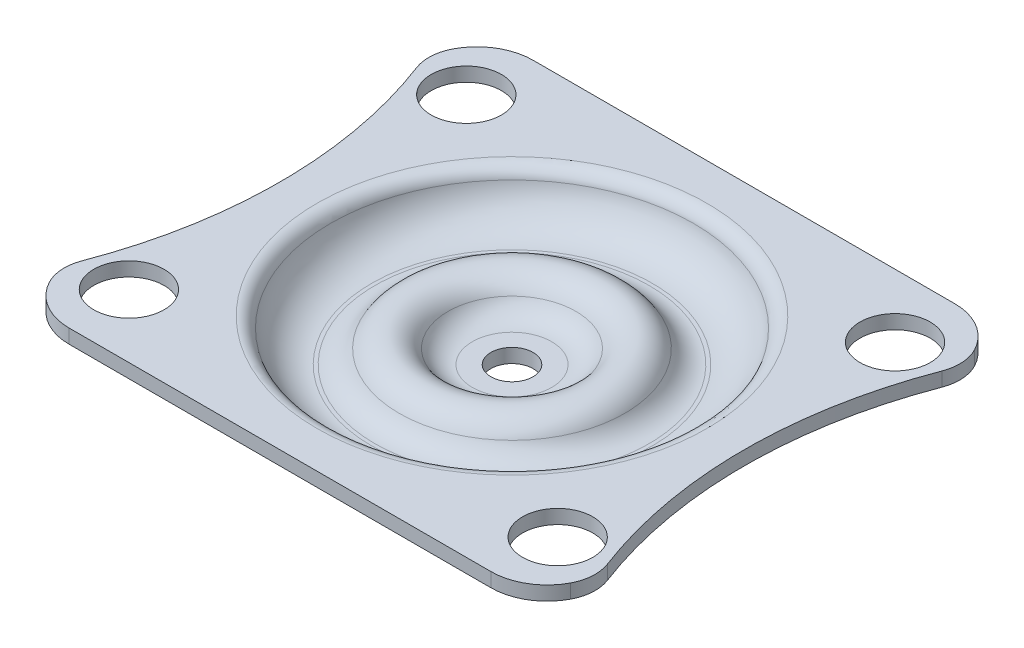
ISO-10303-21;
HEADER;
FILE_DESCRIPTION(('STEP AP214'),'2;1');
FILE_NAME('part.step','',(''),(''),'','','');
FILE_SCHEMA(('AUTOMOTIVE_DESIGN { 1 0 10303 214 1 1 1 1 }'));
ENDSEC;
DATA;
#1=APPLICATION_CONTEXT('core data for automotive mechanical design processes');
#2=APPLICATION_PROTOCOL_DEFINITION('international standard','automotive_design',2000,#1);
#3=PRODUCT_CONTEXT('',#1,'mechanical');
#4=PRODUCT('Part','Part','',(#3));
#5=PRODUCT_RELATED_PRODUCT_CATEGORY('part','',(#4));
#6=PRODUCT_DEFINITION_FORMATION('','',#4);
#7=PRODUCT_DEFINITION_CONTEXT('part definition',#1,'design');
#8=PRODUCT_DEFINITION('design','',#6,#7);
#9=PRODUCT_DEFINITION_SHAPE('','',#8);
#10=(LENGTH_UNIT() NAMED_UNIT(*) SI_UNIT(.MILLI.,.METRE.));
#11=(NAMED_UNIT(*) PLANE_ANGLE_UNIT() SI_UNIT($,.RADIAN.));
#12=(NAMED_UNIT(*) SI_UNIT($,.STERADIAN.) SOLID_ANGLE_UNIT());
#13=UNCERTAINTY_MEASURE_WITH_UNIT(LENGTH_MEASURE(1.E-05),#10,'distance_accuracy_value','');
#14=(GEOMETRIC_REPRESENTATION_CONTEXT(3) GLOBAL_UNCERTAINTY_ASSIGNED_CONTEXT((#13)) GLOBAL_UNIT_ASSIGNED_CONTEXT((#10,
#11,#12)) REPRESENTATION_CONTEXT('',''));
#15=CARTESIAN_POINT('',(0.,0.,0.));
#16=DIRECTION('',(0.,0.,1.));
#17=DIRECTION('',(1.,0.,0.));
#18=AXIS2_PLACEMENT_3D('',#15,#16,#17);
#19=CARTESIAN_POINT('',(-2.82179676972449,-4.,0.));
#20=DIRECTION('',(0.,-1.,0.));
#21=DIRECTION('',(0.,0.,-1.));
#22=AXIS2_PLACEMENT_3D('',#19,#20,#21);
#23=PLANE('',#22);
#24=CARTESIAN_POINT('',(0.,-4.,0.));
#25=DIRECTION('',(0.,1.,0.));
#26=DIRECTION('',(0.,0.,1.));
#27=AXIS2_PLACEMENT_3D('',#24,#25,#26);
#28=CIRCLE('',#27,1.5);
#29=CARTESIAN_POINT('',(0.,-4.,1.5));
#30=VERTEX_POINT('',#29);
#31=EDGE_CURVE('E11',#30,#30,#28,.T.);
#32=ORIENTED_EDGE('',*,*,#31,.T.);
#33=EDGE_LOOP('',(#32));
#34=FACE_BOUND('',#33,.T.);
#35=CARTESIAN_POINT('',(0.,-4.,0.));
#36=DIRECTION('',(0.,1.,0.));
#37=DIRECTION('',(0.,0.,1.));
#38=AXIS2_PLACEMENT_3D('',#35,#36,#37);
#39=CIRCLE('',#38,2.82179676972449);
#40=CARTESIAN_POINT('',(0.,-4.,2.82179676972449));
#41=VERTEX_POINT('',#40);
#42=EDGE_CURVE('E192',#41,#41,#39,.T.);
#43=ORIENTED_EDGE('',*,*,#42,.F.);
#44=EDGE_LOOP('',(#43));
#45=FACE_BOUND('',#44,.T.);
#46=ADVANCED_FACE('F33',(#34,#45),#23,.T.);
#47=CARTESIAN_POINT('',(0.,5.37373737373738,0.));
#48=DIRECTION('',(0.,1.,0.));
#49=DIRECTION('',(0.,0.,1.));
#50=AXIS2_PLACEMENT_3D('',#47,#48,#49);
#51=CYLINDRICAL_SURFACE('',#50,1.5);
#52=ORIENTED_EDGE('',*,*,#31,.F.);
#53=EDGE_LOOP('',(#52));
#54=FACE_BOUND('',#53,.T.);
#55=CARTESIAN_POINT('',(0.,-3.,0.));
#56=DIRECTION('',(0.,1.,0.));
#57=DIRECTION('',(0.,0.,1.));
#58=AXIS2_PLACEMENT_3D('',#55,#56,#57);
#59=CIRCLE('',#58,1.5);
#60=CARTESIAN_POINT('',(0.,-3.,1.5));
#61=VERTEX_POINT('',#60);
#62=EDGE_CURVE('E41',#61,#61,#59,.T.);
#63=ORIENTED_EDGE('',*,*,#62,.T.);
#64=EDGE_LOOP('',(#63));
#65=FACE_BOUND('',#64,.T.);
#66=ADVANCED_FACE('F250',(#54,#65),#51,.F.);
#67=CARTESIAN_POINT('',(-2.82179676972449,-3.,0.));
#68=DIRECTION('',(0.,-1.,0.));
#69=DIRECTION('',(0.,0.,-1.));
#70=AXIS2_PLACEMENT_3D('',#67,#68,#69);
#71=PLANE('',#70);
#72=ORIENTED_EDGE('',*,*,#62,.F.);
#73=EDGE_LOOP('',(#72));
#74=FACE_BOUND('',#73,.T.);
#75=CARTESIAN_POINT('',(0.,-3.,0.));
#76=DIRECTION('',(0.,1.,0.));
#77=DIRECTION('',(0.,0.,1.));
#78=AXIS2_PLACEMENT_3D('',#75,#76,#77);
#79=CIRCLE('',#78,2.82179676972449);
#80=CARTESIAN_POINT('',(0.,-3.,2.82179676972449));
#81=VERTEX_POINT('',#80);
#82=EDGE_CURVE('E245',#81,#81,#79,.T.);
#83=ORIENTED_EDGE('',*,*,#82,.T.);
#84=EDGE_LOOP('',(#83));
#85=FACE_BOUND('',#84,.T.);
#86=ADVANCED_FACE('F252',(#74,#85),#71,.F.);
#87=CARTESIAN_POINT('',(0.,-1.,0.));
#88=DIRECTION('',(0.,1.,0.));
#89=DIRECTION('',(0.,0.,1.));
#90=AXIS2_PLACEMENT_3D('',#87,#88,#89);
#91=TOROIDAL_SURFACE('',#90,2.82179676972449,2.);
#92=ORIENTED_EDGE('',*,*,#82,.F.);
#93=EDGE_LOOP('',(#92));
#94=FACE_BOUND('',#93,.T.);
#95=CARTESIAN_POINT('',(0.,-2.,0.));
#96=DIRECTION('',(0.,1.,0.));
#97=DIRECTION('',(0.,0.,1.));
#98=AXIS2_PLACEMENT_3D('',#95,#96,#97);
#99=CIRCLE('',#98,4.55384757729337);
#100=CARTESIAN_POINT('',(0.,-2.,4.55384757729337));
#101=VERTEX_POINT('',#100);
#102=EDGE_CURVE('E242',#101,#101,#99,.T.);
#103=ORIENTED_EDGE('',*,*,#102,.T.);
#104=EDGE_LOOP('',(#103));
#105=FACE_BOUND('',#104,.T.);
#106=ADVANCED_FACE('F255',(#94,#105),#91,.F.);
#107=CARTESIAN_POINT('',(0.,-3.,0.));
#108=DIRECTION('',(0.,1.,0.));
#109=DIRECTION('',(0.,0.,1.));
#110=AXIS2_PLACEMENT_3D('',#107,#108,#109);
#111=TOROIDAL_SURFACE('',#110,6.28589838486224,2.);
#112=ORIENTED_EDGE('',*,*,#102,.F.);
#113=EDGE_LOOP('',(#112));
#114=FACE_BOUND('',#113,.T.);
#115=CARTESIAN_POINT('',(0.,-2.,0.));
#116=DIRECTION('',(0.,1.,0.));
#117=DIRECTION('',(0.,0.,1.));
#118=AXIS2_PLACEMENT_3D('',#115,#116,#117);
#119=CIRCLE('',#118,8.01794919243112);
#120=CARTESIAN_POINT('',(0.,-2.,8.01794919243112));
#121=VERTEX_POINT('',#120);
#122=EDGE_CURVE('E239',#121,#121,#119,.T.);
#123=ORIENTED_EDGE('',*,*,#122,.T.);
#124=EDGE_LOOP('',(#123));
#125=FACE_BOUND('',#124,.T.);
#126=ADVANCED_FACE('F261',(#114,#125),#111,.T.);
#127=CARTESIAN_POINT('',(0.,-1.,0.));
#128=DIRECTION('',(0.,1.,0.));
#129=DIRECTION('',(0.,0.,1.));
#130=AXIS2_PLACEMENT_3D('',#127,#128,#129);
#131=TOROIDAL_SURFACE('',#130,9.75,2.);
#132=ORIENTED_EDGE('',*,*,#122,.F.);
#133=EDGE_LOOP('',(#132));
#134=FACE_BOUND('',#133,.T.);
#135=CARTESIAN_POINT('',(0.,-3.,0.));
#136=DIRECTION('',(0.,1.,0.));
#137=DIRECTION('',(0.,0.,1.));
#138=AXIS2_PLACEMENT_3D('',#135,#136,#137);
#139=CIRCLE('',#138,9.75);
#140=CARTESIAN_POINT('',(0.,-3.,9.75));
#141=VERTEX_POINT('',#140);
#142=EDGE_CURVE('E236',#141,#141,#139,.T.);
#143=ORIENTED_EDGE('',*,*,#142,.T.);
#144=EDGE_LOOP('',(#143));
#145=FACE_BOUND('',#144,.T.);
#146=ADVANCED_FACE('F267',(#134,#145),#131,.F.);
#147=CARTESIAN_POINT('',(-10.,-3.,0.));
#148=DIRECTION('',(0.,-1.,0.));
#149=DIRECTION('',(0.,0.,-1.));
#150=AXIS2_PLACEMENT_3D('',#147,#148,#149);
#151=PLANE('',#150);
#152=ORIENTED_EDGE('',*,*,#142,.F.);
#153=EDGE_LOOP('',(#152));
#154=FACE_BOUND('',#153,.T.);
#155=CARTESIAN_POINT('',(0.,-3.,0.));
#156=DIRECTION('',(0.,1.,0.));
#157=DIRECTION('',(0.,0.,1.));
#158=AXIS2_PLACEMENT_3D('',#155,#156,#157);
#159=CIRCLE('',#158,10.);
#160=CARTESIAN_POINT('',(0.,-3.,10.));
#161=VERTEX_POINT('',#160);
#162=EDGE_CURVE('E233',#161,#161,#159,.T.);
#163=ORIENTED_EDGE('',*,*,#162,.T.);
#164=EDGE_LOOP('',(#163));
#165=FACE_BOUND('',#164,.T.);
#166=ADVANCED_FACE('F273',(#154,#165),#151,.F.);
#167=CARTESIAN_POINT('',(0.,0.,0.));
#168=DIRECTION('',(0.,1.,0.));
#169=DIRECTION('',(0.,0.,1.));
#170=AXIS2_PLACEMENT_3D('',#167,#168,#169);
#171=TOROIDAL_SURFACE('',#170,10.,3.);
#172=ORIENTED_EDGE('',*,*,#162,.F.);
#173=EDGE_LOOP('',(#172));
#174=FACE_BOUND('',#173,.T.);
#175=CARTESIAN_POINT('',(0.,-0.75,0.));
#176=DIRECTION('',(0.,1.,0.));
#177=DIRECTION('',(0.,0.,1.));
#178=AXIS2_PLACEMENT_3D('',#175,#176,#177);
#179=CIRCLE('',#178,12.9047375096556);
#180=CARTESIAN_POINT('',(0.,-0.75,12.9047375096556));
#181=VERTEX_POINT('',#180);
#182=EDGE_CURVE('E230',#181,#181,#179,.T.);
#183=ORIENTED_EDGE('',*,*,#182,.T.);
#184=EDGE_LOOP('',(#183));
#185=FACE_BOUND('',#184,.T.);
#186=ADVANCED_FACE('F279',(#174,#185),#171,.F.);
#187=CARTESIAN_POINT('',(0.,-1.,0.));
#188=DIRECTION('',(0.,1.,0.));
#189=DIRECTION('',(0.,0.,1.));
#190=AXIS2_PLACEMENT_3D('',#187,#188,#189);
#191=TOROIDAL_SURFACE('',#190,13.8729833462074,1.);
#192=ORIENTED_EDGE('',*,*,#182,.F.);
#193=EDGE_LOOP('',(#192));
#194=FACE_BOUND('',#193,.T.);
#195=CARTESIAN_POINT('',(0.,0.,0.));
#196=DIRECTION('',(0.,1.,0.));
#197=DIRECTION('',(0.,0.,1.));
#198=AXIS2_PLACEMENT_3D('',#195,#196,#197);
#199=CIRCLE('',#198,13.8729833462074);
#200=CARTESIAN_POINT('',(0.,0.,13.8729833462074));
#201=VERTEX_POINT('',#200);
#202=EDGE_CURVE('E227',#201,#201,#199,.T.);
#203=ORIENTED_EDGE('',*,*,#202,.T.);
#204=EDGE_LOOP('',(#203));
#205=FACE_BOUND('',#204,.T.);
#206=ADVANCED_FACE('F285',(#194,#205),#191,.T.);
#207=CARTESIAN_POINT('',(-15.,0.,0.));
#208=DIRECTION('',(0.,-1.,0.));
#209=DIRECTION('',(0.,0.,-1.));
#210=AXIS2_PLACEMENT_3D('',#207,#208,#209);
#211=PLANE('',#210);
#212=ORIENTED_EDGE('',*,*,#202,.F.);
#213=EDGE_LOOP('',(#212));
#214=FACE_BOUND('',#213,.T.);
#215=CARTESIAN_POINT('',(15.25,0.,12.));
#216=DIRECTION('',(0.,1.,0.));
#217=DIRECTION('',(0.,0.,1.));
#218=AXIS2_PLACEMENT_3D('',#215,#216,#217);
#219=CIRCLE('',#218,2.5);
#220=CARTESIAN_POINT('',(15.25,0.,14.5));
#221=VERTEX_POINT('',#220);
#222=EDGE_CURVE('E301',#221,#221,#219,.T.);
#223=ORIENTED_EDGE('',*,*,#222,.F.);
#224=EDGE_LOOP('',(#223));
#225=FACE_BOUND('',#224,.T.);
#226=CARTESIAN_POINT('',(-15.25,0.,-12.));
#227=DIRECTION('',(0.,1.,0.));
#228=DIRECTION('',(0.,0.,1.));
#229=AXIS2_PLACEMENT_3D('',#226,#227,#228);
#230=CIRCLE('',#229,2.5);
#231=CARTESIAN_POINT('',(-15.25,0.,-9.5));
#232=VERTEX_POINT('',#231);
#233=EDGE_CURVE('E305',#232,#232,#230,.T.);
#234=ORIENTED_EDGE('',*,*,#233,.F.);
#235=EDGE_LOOP('',(#234));
#236=FACE_BOUND('',#235,.T.);
#237=CARTESIAN_POINT('',(15.25,0.,-12.));
#238=DIRECTION('',(0.,1.,0.));
#239=DIRECTION('',(0.,0.,-1.));
#240=AXIS2_PLACEMENT_3D('',#237,#238,#239);
#241=CIRCLE('',#240,2.5);
#242=CARTESIAN_POINT('',(15.25,0.,-14.5));
#243=VERTEX_POINT('',#242);
#244=EDGE_CURVE('E309',#243,#243,#241,.T.);
#245=ORIENTED_EDGE('',*,*,#244,.F.);
#246=EDGE_LOOP('',(#245));
#247=FACE_BOUND('',#246,.T.);
#248=CARTESIAN_POINT('',(-15.25,0.,12.));
#249=DIRECTION('',(0.,1.,0.));
#250=DIRECTION('',(0.,0.,-1.));
#251=AXIS2_PLACEMENT_3D('',#248,#249,#250);
#252=CIRCLE('',#251,2.5);
#253=CARTESIAN_POINT('',(-15.25,0.,9.5));
#254=VERTEX_POINT('',#253);
#255=EDGE_CURVE('E313',#254,#254,#252,.T.);
#256=ORIENTED_EDGE('',*,*,#255,.F.);
#257=EDGE_LOOP('',(#256));
#258=FACE_BOUND('',#257,.T.);
#259=CARTESIAN_POINT('',(-15.8823529411764,0.,12.970588235294));
#260=DIRECTION('',(0.,1.,0.));
#261=DIRECTION('',(0.,0.,1.));
#262=AXIS2_PLACEMENT_3D('',#259,#260,#261);
#263=CIRCLE('',#262,3.);
#264=CARTESIAN_POINT('',(-18.6865431103948,0.,11.9045124899274));
#265=VERTEX_POINT('',#264);
#266=CARTESIAN_POINT('',(-18.529411764706,0.,14.3823529411762));
#267=VERTEX_POINT('',#266);
#268=EDGE_CURVE('E156',#265,#267,#263,.T.);
#269=ORIENTED_EDGE('',*,*,#268,.T.);
#270=CARTESIAN_POINT('',(-15.,0.,12.5));
#271=DIRECTION('',(0.,1.,0.));
#272=DIRECTION('',(0.,0.,-1.));
#273=AXIS2_PLACEMENT_3D('',#270,#271,#272);
#274=CIRCLE('',#273,3.99999999999995);
#275=CARTESIAN_POINT('',(-15.,0.,16.5));
#276=VERTEX_POINT('',#275);
#277=EDGE_CURVE('E159',#267,#276,#274,.T.);
#278=ORIENTED_EDGE('',*,*,#277,.T.);
#279=DIRECTION('',(1.,0.,0.));
#280=VECTOR('',#279,1.);
#281=CARTESIAN_POINT('',(-15.,0.,16.5));
#282=LINE('',#281,#280);
#283=CARTESIAN_POINT('',(15.,0.,16.4999999999999));
#284=VERTEX_POINT('',#283);
#285=EDGE_CURVE('E163',#276,#284,#282,.T.);
#286=ORIENTED_EDGE('',*,*,#285,.T.);
#287=CARTESIAN_POINT('',(15.,0.,12.5));
#288=DIRECTION('',(0.,1.,0.));
#289=DIRECTION('',(0.,0.,1.));
#290=AXIS2_PLACEMENT_3D('',#287,#288,#289);
#291=CIRCLE('',#290,3.99999999999995);
#292=CARTESIAN_POINT('',(18.529411764706,0.,14.3823529411761));
#293=VERTEX_POINT('',#292);
#294=EDGE_CURVE('E166',#284,#293,#291,.T.);
#295=ORIENTED_EDGE('',*,*,#294,.T.);
#296=CARTESIAN_POINT('',(15.8823529411764,0.,12.970588235294));
#297=DIRECTION('',(0.,1.,0.));
#298=DIRECTION('',(0.,0.,-1.));
#299=AXIS2_PLACEMENT_3D('',#296,#297,#298);
#300=CIRCLE('',#299,3.);
#301=CARTESIAN_POINT('',(18.6865431103948,0.,11.9045124899274));
#302=VERTEX_POINT('',#301);
#303=EDGE_CURVE('E169',#293,#302,#300,.T.);
#304=ORIENTED_EDGE('',*,*,#303,.T.);
#305=CARTESIAN_POINT('',(50.,0.,0.));
#306=DIRECTION('',(0.,-1.,0.));
#307=DIRECTION('',(0.,0.,-1.));
#308=AXIS2_PLACEMENT_3D('',#305,#306,#307);
#309=CIRCLE('',#308,33.5);
#310=CARTESIAN_POINT('',(18.6865431103948,0.,-11.9045124899274));
#311=VERTEX_POINT('',#310);
#312=EDGE_CURVE('E172',#302,#311,#309,.T.);
#313=ORIENTED_EDGE('',*,*,#312,.T.);
#314=CARTESIAN_POINT('',(15.8823529411764,0.,-12.970588235294));
#315=DIRECTION('',(0.,1.,0.));
#316=DIRECTION('',(0.,0.,1.));
#317=AXIS2_PLACEMENT_3D('',#314,#315,#316);
#318=CIRCLE('',#317,3.);
#319=CARTESIAN_POINT('',(18.529411764706,0.,-14.3823529411762));
#320=VERTEX_POINT('',#319);
#321=EDGE_CURVE('E175',#311,#320,#318,.T.);
#322=ORIENTED_EDGE('',*,*,#321,.T.);
#323=CARTESIAN_POINT('',(15.,0.,-12.5));
#324=DIRECTION('',(0.,1.,0.));
#325=DIRECTION('',(0.,0.,-1.));
#326=AXIS2_PLACEMENT_3D('',#323,#324,#325);
#327=CIRCLE('',#326,3.99999999999995);
#328=CARTESIAN_POINT('',(15.,0.,-16.5));
#329=VERTEX_POINT('',#328);
#330=EDGE_CURVE('E178',#320,#329,#327,.T.);
#331=ORIENTED_EDGE('',*,*,#330,.T.);
#332=DIRECTION('',(-1.,0.,0.));
#333=VECTOR('',#332,1.);
#334=CARTESIAN_POINT('',(-15.,0.,-16.5));
#335=LINE('',#334,#333);
#336=CARTESIAN_POINT('',(-15.,0.,-16.5));
#337=VERTEX_POINT('',#336);
#338=EDGE_CURVE('E181',#329,#337,#335,.T.);
#339=ORIENTED_EDGE('',*,*,#338,.T.);
#340=CARTESIAN_POINT('',(-15.,0.,-12.5));
#341=DIRECTION('',(0.,1.,0.));
#342=DIRECTION('',(0.,0.,1.));
#343=AXIS2_PLACEMENT_3D('',#340,#341,#342);
#344=CIRCLE('',#343,3.99999999999995);
#345=CARTESIAN_POINT('',(-18.529411764706,0.,-14.3823529411761));
#346=VERTEX_POINT('',#345);
#347=EDGE_CURVE('E184',#337,#346,#344,.T.);
#348=ORIENTED_EDGE('',*,*,#347,.T.);
#349=CARTESIAN_POINT('',(-15.8823529411764,0.,-12.970588235294));
#350=DIRECTION('',(0.,1.,0.));
#351=DIRECTION('',(0.,0.,-1.));
#352=AXIS2_PLACEMENT_3D('',#349,#350,#351);
#353=CIRCLE('',#352,3.);
#354=CARTESIAN_POINT('',(-18.6865431103948,0.,-11.9045124899274));
#355=VERTEX_POINT('',#354);
#356=EDGE_CURVE('E133',#346,#355,#353,.T.);
#357=ORIENTED_EDGE('',*,*,#356,.T.);
#358=CARTESIAN_POINT('',(-50.,0.,0.));
#359=DIRECTION('',(0.,-1.,0.));
#360=DIRECTION('',(0.,0.,1.));
#361=AXIS2_PLACEMENT_3D('',#358,#359,#360);
#362=CIRCLE('',#361,33.5);
#363=EDGE_CURVE('E187',#355,#265,#362,.T.);
#364=ORIENTED_EDGE('',*,*,#363,.T.);
#365=EDGE_LOOP('',(#269,#278,#286,#295,#304,#313,#322,#331,#339,#348,#357,#364));
#366=FACE_BOUND('',#365,.T.);
#367=ADVANCED_FACE('F291',(#214,#225,#236,#247,#258,#366),#211,.F.);
#368=CARTESIAN_POINT('',(-15.,-1.,0.));
#369=DIRECTION('',(0.,-1.,0.));
#370=DIRECTION('',(0.,0.,-1.));
#371=AXIS2_PLACEMENT_3D('',#368,#369,#370);
#372=PLANE('',#371);
#373=CARTESIAN_POINT('',(0.,-1.,0.));
#374=DIRECTION('',(0.,1.,0.));
#375=DIRECTION('',(0.,0.,1.));
#376=AXIS2_PLACEMENT_3D('',#373,#374,#375);
#377=CIRCLE('',#376,13.8729833462074);
#378=CARTESIAN_POINT('',(0.,-1.,13.8729833462074));
#379=VERTEX_POINT('',#378);
#380=EDGE_CURVE('E224',#379,#379,#377,.T.);
#381=ORIENTED_EDGE('',*,*,#380,.T.);
#382=EDGE_LOOP('',(#381));
#383=FACE_BOUND('',#382,.T.);
#384=CARTESIAN_POINT('',(15.25,-1.,12.));
#385=DIRECTION('',(0.,1.,0.));
#386=DIRECTION('',(0.,0.,1.));
#387=AXIS2_PLACEMENT_3D('',#384,#385,#386);
#388=CIRCLE('',#387,2.5);
#389=CARTESIAN_POINT('',(15.25,-1.,14.5));
#390=VERTEX_POINT('',#389);
#391=EDGE_CURVE('E409',#390,#390,#388,.T.);
#392=ORIENTED_EDGE('',*,*,#391,.T.);
#393=EDGE_LOOP('',(#392));
#394=FACE_BOUND('',#393,.T.);
#395=CARTESIAN_POINT('',(-15.25,-1.,-12.));
#396=DIRECTION('',(0.,1.,0.));
#397=DIRECTION('',(0.,0.,1.));
#398=AXIS2_PLACEMENT_3D('',#395,#396,#397);
#399=CIRCLE('',#398,2.5);
#400=CARTESIAN_POINT('',(-15.25,-1.,-9.5));
#401=VERTEX_POINT('',#400);
#402=EDGE_CURVE('E413',#401,#401,#399,.T.);
#403=ORIENTED_EDGE('',*,*,#402,.T.);
#404=EDGE_LOOP('',(#403));
#405=FACE_BOUND('',#404,.T.);
#406=CARTESIAN_POINT('',(15.25,-1.,-12.));
#407=DIRECTION('',(0.,1.,0.));
#408=DIRECTION('',(0.,0.,-1.));
#409=AXIS2_PLACEMENT_3D('',#406,#407,#408);
#410=CIRCLE('',#409,2.5);
#411=CARTESIAN_POINT('',(15.25,-1.,-14.5));
#412=VERTEX_POINT('',#411);
#413=EDGE_CURVE('E417',#412,#412,#410,.T.);
#414=ORIENTED_EDGE('',*,*,#413,.T.);
#415=EDGE_LOOP('',(#414));
#416=FACE_BOUND('',#415,.T.);
#417=CARTESIAN_POINT('',(-15.25,-1.,12.));
#418=DIRECTION('',(0.,1.,0.));
#419=DIRECTION('',(0.,0.,-1.));
#420=AXIS2_PLACEMENT_3D('',#417,#418,#419);
#421=CIRCLE('',#420,2.5);
#422=CARTESIAN_POINT('',(-15.25,-1.,9.5));
#423=VERTEX_POINT('',#422);
#424=EDGE_CURVE('E160',#423,#423,#421,.T.);
#425=ORIENTED_EDGE('',*,*,#424,.T.);
#426=EDGE_LOOP('',(#425));
#427=FACE_BOUND('',#426,.T.);
#428=CARTESIAN_POINT('',(-15.8823529411764,-1.,12.970588235294));
#429=DIRECTION('',(0.,1.,0.));
#430=DIRECTION('',(0.,0.,1.));
#431=AXIS2_PLACEMENT_3D('',#428,#429,#430);
#432=CIRCLE('',#431,3.);
#433=CARTESIAN_POINT('',(-18.6865431103948,-1.,11.9045124899274));
#434=VERTEX_POINT('',#433);
#435=CARTESIAN_POINT('',(-18.529411764706,-1.,14.3823529411762));
#436=VERTEX_POINT('',#435);
#437=EDGE_CURVE('E190',#434,#436,#432,.T.);
#438=ORIENTED_EDGE('',*,*,#437,.F.);
#439=CARTESIAN_POINT('',(-50.,-1.,0.));
#440=DIRECTION('',(0.,-1.,0.));
#441=DIRECTION('',(0.,0.,1.));
#442=AXIS2_PLACEMENT_3D('',#439,#440,#441);
#443=CIRCLE('',#442,33.5);
#444=CARTESIAN_POINT('',(-18.6865431103948,-1.,-11.9045124899274));
#445=VERTEX_POINT('',#444);
#446=EDGE_CURVE('E146',#445,#434,#443,.T.);
#447=ORIENTED_EDGE('',*,*,#446,.F.);
#448=CARTESIAN_POINT('',(-15.8823529411764,-1.,-12.970588235294));
#449=DIRECTION('',(0.,1.,0.));
#450=DIRECTION('',(0.,0.,-1.));
#451=AXIS2_PLACEMENT_3D('',#448,#449,#450);
#452=CIRCLE('',#451,3.);
#453=CARTESIAN_POINT('',(-18.529411764706,-1.,-14.3823529411761));
#454=VERTEX_POINT('',#453);
#455=EDGE_CURVE('E131',#454,#445,#452,.T.);
#456=ORIENTED_EDGE('',*,*,#455,.F.);
#457=CARTESIAN_POINT('',(-15.,-1.,-12.5));
#458=DIRECTION('',(0.,1.,0.));
#459=DIRECTION('',(0.,0.,1.));
#460=AXIS2_PLACEMENT_3D('',#457,#458,#459);
#461=CIRCLE('',#460,3.99999999999995);
#462=CARTESIAN_POINT('',(-15.,-1.,-16.5));
#463=VERTEX_POINT('',#462);
#464=EDGE_CURVE('E144',#463,#454,#461,.T.);
#465=ORIENTED_EDGE('',*,*,#464,.F.);
#466=DIRECTION('',(-1.,0.,0.));
#467=VECTOR('',#466,1.);
#468=CARTESIAN_POINT('',(-15.,-1.,-16.5));
#469=LINE('',#468,#467);
#470=CARTESIAN_POINT('',(15.,-1.,-16.5));
#471=VERTEX_POINT('',#470);
#472=EDGE_CURVE('E149',#471,#463,#469,.T.);
#473=ORIENTED_EDGE('',*,*,#472,.F.);
#474=CARTESIAN_POINT('',(15.,-1.,-12.5));
#475=DIRECTION('',(0.,1.,0.));
#476=DIRECTION('',(0.,0.,-1.));
#477=AXIS2_PLACEMENT_3D('',#474,#475,#476);
#478=CIRCLE('',#477,3.99999999999995);
#479=CARTESIAN_POINT('',(18.529411764706,-1.,-14.3823529411762));
#480=VERTEX_POINT('',#479);
#481=EDGE_CURVE('E151',#480,#471,#478,.T.);
#482=ORIENTED_EDGE('',*,*,#481,.F.);
#483=CARTESIAN_POINT('',(15.8823529411764,-1.,-12.970588235294));
#484=DIRECTION('',(0.,1.,0.));
#485=DIRECTION('',(0.,0.,1.));
#486=AXIS2_PLACEMENT_3D('',#483,#484,#485);
#487=CIRCLE('',#486,3.);
#488=CARTESIAN_POINT('',(18.6865431103948,-1.,-11.9045124899274));
#489=VERTEX_POINT('',#488);
#490=EDGE_CURVE('E345',#489,#480,#487,.T.);
#491=ORIENTED_EDGE('',*,*,#490,.F.);
#492=CARTESIAN_POINT('',(50.,-1.,0.));
#493=DIRECTION('',(0.,-1.,0.));
#494=DIRECTION('',(0.,0.,-1.));
#495=AXIS2_PLACEMENT_3D('',#492,#493,#494);
#496=CIRCLE('',#495,33.5);
#497=CARTESIAN_POINT('',(18.6865431103948,-1.,11.9045124899274));
#498=VERTEX_POINT('',#497);
#499=EDGE_CURVE('E432',#498,#489,#496,.T.);
#500=ORIENTED_EDGE('',*,*,#499,.F.);
#501=CARTESIAN_POINT('',(15.8823529411764,-1.,12.970588235294));
#502=DIRECTION('',(0.,1.,0.));
#503=DIRECTION('',(0.,0.,-1.));
#504=AXIS2_PLACEMENT_3D('',#501,#502,#503);
#505=CIRCLE('',#504,3.);
#506=CARTESIAN_POINT('',(18.529411764706,-1.,14.3823529411761));
#507=VERTEX_POINT('',#506);
#508=EDGE_CURVE('E334',#507,#498,#505,.T.);
#509=ORIENTED_EDGE('',*,*,#508,.F.);
#510=CARTESIAN_POINT('',(15.,-1.,12.5));
#511=DIRECTION('',(0.,1.,0.));
#512=DIRECTION('',(0.,0.,1.));
#513=AXIS2_PLACEMENT_3D('',#510,#511,#512);
#514=CIRCLE('',#513,3.99999999999995);
#515=CARTESIAN_POINT('',(15.,-1.,16.4999999999999));
#516=VERTEX_POINT('',#515);
#517=EDGE_CURVE('E328',#516,#507,#514,.T.);
#518=ORIENTED_EDGE('',*,*,#517,.F.);
#519=DIRECTION('',(1.,0.,0.));
#520=VECTOR('',#519,1.);
#521=CARTESIAN_POINT('',(-15.,-1.,16.5));
#522=LINE('',#521,#520);
#523=CARTESIAN_POINT('',(-15.,-1.,16.5));
#524=VERTEX_POINT('',#523);
#525=EDGE_CURVE('E428',#524,#516,#522,.T.);
#526=ORIENTED_EDGE('',*,*,#525,.F.);
#527=CARTESIAN_POINT('',(-15.,-1.,12.5));
#528=DIRECTION('',(0.,1.,0.));
#529=DIRECTION('',(0.,0.,-1.));
#530=AXIS2_PLACEMENT_3D('',#527,#528,#529);
#531=CIRCLE('',#530,3.99999999999995);
#532=EDGE_CURVE('E317',#436,#524,#531,.T.);
#533=ORIENTED_EDGE('',*,*,#532,.F.);
#534=EDGE_LOOP('',(#438,#447,#456,#465,#473,#482,#491,#500,#509,#518,#526,#533));
#535=FACE_BOUND('',#534,.T.);
#536=ADVANCED_FACE('F142',(#383,#394,#405,#416,#427,#535),#372,.T.);
#537=CARTESIAN_POINT('',(0.,0.,0.));
#538=DIRECTION('',(0.,1.,0.));
#539=DIRECTION('',(0.,0.,1.));
#540=AXIS2_PLACEMENT_3D('',#537,#538,#539);
#541=TOROIDAL_SURFACE('',#540,10.,4.);
#542=CARTESIAN_POINT('',(0.,-4.,0.));
#543=DIRECTION('',(0.,1.,0.));
#544=DIRECTION('',(0.,0.,1.));
#545=AXIS2_PLACEMENT_3D('',#542,#543,#544);
#546=CIRCLE('',#545,10.);
#547=CARTESIAN_POINT('',(0.,-4.,10.));
#548=VERTEX_POINT('',#547);
#549=EDGE_CURVE('E221',#548,#548,#546,.T.);
#550=ORIENTED_EDGE('',*,*,#549,.T.);
#551=EDGE_LOOP('',(#550));
#552=FACE_BOUND('',#551,.T.);
#553=ORIENTED_EDGE('',*,*,#380,.F.);
#554=EDGE_LOOP('',(#553));
#555=FACE_BOUND('',#554,.T.);
#556=ADVANCED_FACE('F394',(#552,#555),#541,.T.);
#557=CARTESIAN_POINT('',(-10.,-4.,0.));
#558=DIRECTION('',(0.,-1.,0.));
#559=DIRECTION('',(0.,0.,-1.));
#560=AXIS2_PLACEMENT_3D('',#557,#558,#559);
#561=PLANE('',#560);
#562=CARTESIAN_POINT('',(0.,-4.,0.));
#563=DIRECTION('',(0.,1.,0.));
#564=DIRECTION('',(0.,0.,1.));
#565=AXIS2_PLACEMENT_3D('',#562,#563,#564);
#566=CIRCLE('',#565,9.75);
#567=CARTESIAN_POINT('',(0.,-4.,9.75));
#568=VERTEX_POINT('',#567);
#569=EDGE_CURVE('E218',#568,#568,#566,.T.);
#570=ORIENTED_EDGE('',*,*,#569,.T.);
#571=EDGE_LOOP('',(#570));
#572=FACE_BOUND('',#571,.T.);
#573=ORIENTED_EDGE('',*,*,#549,.F.);
#574=EDGE_LOOP('',(#573));
#575=FACE_BOUND('',#574,.T.);
#576=ADVANCED_FACE('F388',(#572,#575),#561,.T.);
#577=CARTESIAN_POINT('',(0.,-1.,0.));
#578=DIRECTION('',(0.,1.,0.));
#579=DIRECTION('',(0.,0.,1.));
#580=AXIS2_PLACEMENT_3D('',#577,#578,#579);
#581=TOROIDAL_SURFACE('',#580,9.75,3.);
#582=CARTESIAN_POINT('',(0.,-2.5,0.));
#583=DIRECTION('',(0.,1.,0.));
#584=DIRECTION('',(0.,0.,1.));
#585=AXIS2_PLACEMENT_3D('',#582,#583,#584);
#586=CIRCLE('',#585,7.15192378864668);
#587=CARTESIAN_POINT('',(0.,-2.5,7.15192378864668));
#588=VERTEX_POINT('',#587);
#589=EDGE_CURVE('E215',#588,#588,#586,.T.);
#590=ORIENTED_EDGE('',*,*,#589,.T.);
#591=EDGE_LOOP('',(#590));
#592=FACE_BOUND('',#591,.T.);
#593=ORIENTED_EDGE('',*,*,#569,.F.);
#594=EDGE_LOOP('',(#593));
#595=FACE_BOUND('',#594,.T.);
#596=ADVANCED_FACE('F382',(#592,#595),#581,.T.);
#597=CARTESIAN_POINT('',(0.,-3.,0.));
#598=DIRECTION('',(0.,1.,0.));
#599=DIRECTION('',(0.,0.,1.));
#600=AXIS2_PLACEMENT_3D('',#597,#598,#599);
#601=TOROIDAL_SURFACE('',#600,6.28589838486224,1.);
#602=CARTESIAN_POINT('',(0.,-2.5,0.));
#603=DIRECTION('',(0.,1.,0.));
#604=DIRECTION('',(0.,0.,1.));
#605=AXIS2_PLACEMENT_3D('',#602,#603,#604);
#606=CIRCLE('',#605,5.4198729810778);
#607=CARTESIAN_POINT('',(0.,-2.5,5.4198729810778));
#608=VERTEX_POINT('',#607);
#609=EDGE_CURVE('E212',#608,#608,#606,.T.);
#610=ORIENTED_EDGE('',*,*,#609,.T.);
#611=EDGE_LOOP('',(#610));
#612=FACE_BOUND('',#611,.T.);
#613=ORIENTED_EDGE('',*,*,#589,.F.);
#614=EDGE_LOOP('',(#613));
#615=FACE_BOUND('',#614,.T.);
#616=ADVANCED_FACE('F376',(#612,#615),#601,.F.);
#617=CARTESIAN_POINT('',(0.,-1.,0.));
#618=DIRECTION('',(0.,1.,0.));
#619=DIRECTION('',(0.,0.,1.));
#620=AXIS2_PLACEMENT_3D('',#617,#618,#619);
#621=DEGENERATE_TOROIDAL_SURFACE('',#620,2.82179676972449,3.,.T.);
#622=ORIENTED_EDGE('',*,*,#42,.T.);
#623=EDGE_LOOP('',(#622));
#624=FACE_BOUND('',#623,.T.);
#625=ORIENTED_EDGE('',*,*,#609,.F.);
#626=EDGE_LOOP('',(#625));
#627=FACE_BOUND('',#626,.T.);
#628=ADVANCED_FACE('F361',(#624,#627),#621,.T.);
#629=CARTESIAN_POINT('',(-15.8823529411764,-1.,12.970588235294));
#630=DIRECTION('',(0.,1.,0.));
#631=DIRECTION('',(0.,0.,1.));
#632=AXIS2_PLACEMENT_3D('',#629,#630,#631);
#633=CYLINDRICAL_SURFACE('',#632,3.);
#634=ORIENTED_EDGE('',*,*,#268,.F.);
#635=DIRECTION('',(0.,1.,0.));
#636=VECTOR('',#635,1.);
#637=CARTESIAN_POINT('',(-18.6865431103948,-1.,11.9045124899274));
#638=LINE('',#637,#636);
#639=EDGE_CURVE('E49',#434,#265,#638,.T.);
#640=ORIENTED_EDGE('',*,*,#639,.F.);
#641=ORIENTED_EDGE('',*,*,#437,.T.);
#642=DIRECTION('',(0.,1.,0.));
#643=VECTOR('',#642,1.);
#644=CARTESIAN_POINT('',(-18.529411764706,-1.,14.3823529411762));
#645=LINE('',#644,#643);
#646=EDGE_CURVE('E102',#436,#267,#645,.T.);
#647=ORIENTED_EDGE('',*,*,#646,.T.);
#648=EDGE_LOOP('',(#634,#640,#641,#647));
#649=FACE_BOUND('',#648,.T.);
#650=ADVANCED_FACE('F314',(#649),#633,.T.);
#651=CARTESIAN_POINT('',(-50.,-1.,0.));
#652=DIRECTION('',(0.,1.,0.));
#653=DIRECTION('',(0.,0.,1.));
#654=AXIS2_PLACEMENT_3D('',#651,#652,#653);
#655=CYLINDRICAL_SURFACE('',#654,33.5);
#656=ORIENTED_EDGE('',*,*,#363,.F.);
#657=DIRECTION('',(0.,1.,0.));
#658=VECTOR('',#657,1.);
#659=CARTESIAN_POINT('',(-18.6865431103948,-1.,-11.9045124899274));
#660=LINE('',#659,#658);
#661=EDGE_CURVE('E90',#445,#355,#660,.T.);
#662=ORIENTED_EDGE('',*,*,#661,.F.);
#663=ORIENTED_EDGE('',*,*,#446,.T.);
#664=ORIENTED_EDGE('',*,*,#639,.T.);
#665=EDGE_LOOP('',(#656,#662,#663,#664));
#666=FACE_BOUND('',#665,.T.);
#667=ADVANCED_FACE('F353',(#666),#655,.F.);
#668=CARTESIAN_POINT('',(-15.8823529411764,-1.,-12.970588235294));
#669=DIRECTION('',(0.,1.,0.));
#670=DIRECTION('',(0.,0.,1.));
#671=AXIS2_PLACEMENT_3D('',#668,#669,#670);
#672=CYLINDRICAL_SURFACE('',#671,3.);
#673=ORIENTED_EDGE('',*,*,#356,.F.);
#674=DIRECTION('',(0.,1.,0.));
#675=VECTOR('',#674,1.);
#676=CARTESIAN_POINT('',(-18.529411764706,-1.,-14.3823529411761));
#677=LINE('',#676,#675);
#678=EDGE_CURVE('E128',#454,#346,#677,.T.);
#679=ORIENTED_EDGE('',*,*,#678,.F.);
#680=ORIENTED_EDGE('',*,*,#455,.T.);
#681=ORIENTED_EDGE('',*,*,#661,.T.);
#682=EDGE_LOOP('',(#673,#679,#680,#681));
#683=FACE_BOUND('',#682,.T.);
#684=ADVANCED_FACE('F130',(#683),#672,.T.);
#685=CARTESIAN_POINT('',(-15.,-1.,-12.5));
#686=DIRECTION('',(0.,1.,0.));
#687=DIRECTION('',(0.,0.,1.));
#688=AXIS2_PLACEMENT_3D('',#685,#686,#687);
#689=CYLINDRICAL_SURFACE('',#688,3.99999999999995);
#690=ORIENTED_EDGE('',*,*,#347,.F.);
#691=DIRECTION('',(0.,1.,0.));
#692=VECTOR('',#691,1.);
#693=CARTESIAN_POINT('',(-15.,-1.,-16.5));
#694=LINE('',#693,#692);
#695=EDGE_CURVE('E138',#463,#337,#694,.T.);
#696=ORIENTED_EDGE('',*,*,#695,.F.);
#697=ORIENTED_EDGE('',*,*,#464,.T.);
#698=ORIENTED_EDGE('',*,*,#678,.T.);
#699=EDGE_LOOP('',(#690,#696,#697,#698));
#700=FACE_BOUND('',#699,.T.);
#701=ADVANCED_FACE('F148',(#700),#689,.T.);
#702=CARTESIAN_POINT('',(-15.,-1.,-16.5));
#703=DIRECTION('',(0.,0.,-1.));
#704=DIRECTION('',(-1.,0.,0.));
#705=AXIS2_PLACEMENT_3D('',#702,#703,#704);
#706=PLANE('',#705);
#707=ORIENTED_EDGE('',*,*,#338,.F.);
#708=DIRECTION('',(0.,1.,0.));
#709=VECTOR('',#708,1.);
#710=CARTESIAN_POINT('',(15.,-1.,-16.5));
#711=LINE('',#710,#709);
#712=EDGE_CURVE('E195',#471,#329,#711,.T.);
#713=ORIENTED_EDGE('',*,*,#712,.F.);
#714=ORIENTED_EDGE('',*,*,#472,.T.);
#715=ORIENTED_EDGE('',*,*,#695,.T.);
#716=EDGE_LOOP('',(#707,#713,#714,#715));
#717=FACE_BOUND('',#716,.T.);
#718=ADVANCED_FACE('F352',(#717),#706,.T.);
#719=CARTESIAN_POINT('',(15.,-1.,-12.5));
#720=DIRECTION('',(0.,1.,0.));
#721=DIRECTION('',(0.,0.,1.));
#722=AXIS2_PLACEMENT_3D('',#719,#720,#721);
#723=CYLINDRICAL_SURFACE('',#722,3.99999999999995);
#724=ORIENTED_EDGE('',*,*,#330,.F.);
#725=DIRECTION('',(0.,1.,0.));
#726=VECTOR('',#725,1.);
#727=CARTESIAN_POINT('',(18.529411764706,-1.,-14.3823529411762));
#728=LINE('',#727,#726);
#729=EDGE_CURVE('E197',#480,#320,#728,.T.);
#730=ORIENTED_EDGE('',*,*,#729,.F.);
#731=ORIENTED_EDGE('',*,*,#481,.T.);
#732=ORIENTED_EDGE('',*,*,#712,.T.);
#733=EDGE_LOOP('',(#724,#730,#731,#732));
#734=FACE_BOUND('',#733,.T.);
#735=ADVANCED_FACE('F349',(#734),#723,.T.);
#736=CARTESIAN_POINT('',(15.8823529411764,-1.,-12.970588235294));
#737=DIRECTION('',(0.,1.,0.));
#738=DIRECTION('',(0.,0.,1.));
#739=AXIS2_PLACEMENT_3D('',#736,#737,#738);
#740=CYLINDRICAL_SURFACE('',#739,3.);
#741=ORIENTED_EDGE('',*,*,#321,.F.);
#742=DIRECTION('',(0.,1.,0.));
#743=VECTOR('',#742,1.);
#744=CARTESIAN_POINT('',(18.6865431103948,-1.,-11.9045124899274));
#745=LINE('',#744,#743);
#746=EDGE_CURVE('E199',#489,#311,#745,.T.);
#747=ORIENTED_EDGE('',*,*,#746,.F.);
#748=ORIENTED_EDGE('',*,*,#490,.T.);
#749=ORIENTED_EDGE('',*,*,#729,.T.);
#750=EDGE_LOOP('',(#741,#747,#748,#749));
#751=FACE_BOUND('',#750,.T.);
#752=ADVANCED_FACE('F342',(#751),#740,.T.);
#753=CARTESIAN_POINT('',(50.,-1.,0.));
#754=DIRECTION('',(0.,1.,0.));
#755=DIRECTION('',(0.,0.,1.));
#756=AXIS2_PLACEMENT_3D('',#753,#754,#755);
#757=CYLINDRICAL_SURFACE('',#756,33.5);
#758=ORIENTED_EDGE('',*,*,#312,.F.);
#759=DIRECTION('',(0.,1.,0.));
#760=VECTOR('',#759,1.);
#761=CARTESIAN_POINT('',(18.6865431103948,-1.,11.9045124899274));
#762=LINE('',#761,#760);
#763=EDGE_CURVE('E201',#498,#302,#762,.T.);
#764=ORIENTED_EDGE('',*,*,#763,.F.);
#765=ORIENTED_EDGE('',*,*,#499,.T.);
#766=ORIENTED_EDGE('',*,*,#746,.T.);
#767=EDGE_LOOP('',(#758,#764,#765,#766));
#768=FACE_BOUND('',#767,.T.);
#769=ADVANCED_FACE('F338',(#768),#757,.F.);
#770=CARTESIAN_POINT('',(15.8823529411764,-1.,12.970588235294));
#771=DIRECTION('',(0.,1.,0.));
#772=DIRECTION('',(0.,0.,1.));
#773=AXIS2_PLACEMENT_3D('',#770,#771,#772);
#774=CYLINDRICAL_SURFACE('',#773,3.);
#775=ORIENTED_EDGE('',*,*,#303,.F.);
#776=DIRECTION('',(0.,1.,0.));
#777=VECTOR('',#776,1.);
#778=CARTESIAN_POINT('',(18.529411764706,-1.,14.3823529411761));
#779=LINE('',#778,#777);
#780=EDGE_CURVE('E203',#507,#293,#779,.T.);
#781=ORIENTED_EDGE('',*,*,#780,.F.);
#782=ORIENTED_EDGE('',*,*,#508,.T.);
#783=ORIENTED_EDGE('',*,*,#763,.T.);
#784=EDGE_LOOP('',(#775,#781,#782,#783));
#785=FACE_BOUND('',#784,.T.);
#786=ADVANCED_FACE('F332',(#785),#774,.T.);
#787=CARTESIAN_POINT('',(15.,-1.,12.5));
#788=DIRECTION('',(0.,1.,0.));
#789=DIRECTION('',(0.,0.,1.));
#790=AXIS2_PLACEMENT_3D('',#787,#788,#789);
#791=CYLINDRICAL_SURFACE('',#790,3.99999999999995);
#792=ORIENTED_EDGE('',*,*,#294,.F.);
#793=DIRECTION('',(0.,1.,0.));
#794=VECTOR('',#793,1.);
#795=CARTESIAN_POINT('',(15.,-1.,16.4999999999999));
#796=LINE('',#795,#794);
#797=EDGE_CURVE('E205',#516,#284,#796,.T.);
#798=ORIENTED_EDGE('',*,*,#797,.F.);
#799=ORIENTED_EDGE('',*,*,#517,.T.);
#800=ORIENTED_EDGE('',*,*,#780,.T.);
#801=EDGE_LOOP('',(#792,#798,#799,#800));
#802=FACE_BOUND('',#801,.T.);
#803=ADVANCED_FACE('F325',(#802),#791,.T.);
#804=CARTESIAN_POINT('',(-15.,-1.,16.5));
#805=DIRECTION('',(0.,0.,1.));
#806=DIRECTION('',(1.,0.,0.));
#807=AXIS2_PLACEMENT_3D('',#804,#805,#806);
#808=PLANE('',#807);
#809=ORIENTED_EDGE('',*,*,#285,.F.);
#810=DIRECTION('',(0.,1.,0.));
#811=VECTOR('',#810,1.);
#812=CARTESIAN_POINT('',(-15.,-1.,16.5));
#813=LINE('',#812,#811);
#814=EDGE_CURVE('E207',#524,#276,#813,.T.);
#815=ORIENTED_EDGE('',*,*,#814,.F.);
#816=ORIENTED_EDGE('',*,*,#525,.T.);
#817=ORIENTED_EDGE('',*,*,#797,.T.);
#818=EDGE_LOOP('',(#809,#815,#816,#817));
#819=FACE_BOUND('',#818,.T.);
#820=ADVANCED_FACE('F321',(#819),#808,.T.);
#821=CARTESIAN_POINT('',(-15.,-1.,12.5));
#822=DIRECTION('',(0.,1.,0.));
#823=DIRECTION('',(0.,0.,1.));
#824=AXIS2_PLACEMENT_3D('',#821,#822,#823);
#825=CYLINDRICAL_SURFACE('',#824,3.99999999999995);
#826=ORIENTED_EDGE('',*,*,#277,.F.);
#827=ORIENTED_EDGE('',*,*,#646,.F.);
#828=ORIENTED_EDGE('',*,*,#532,.T.);
#829=ORIENTED_EDGE('',*,*,#814,.T.);
#830=EDGE_LOOP('',(#826,#827,#828,#829));
#831=FACE_BOUND('',#830,.T.);
#832=ADVANCED_FACE('F315',(#831),#825,.T.);
#833=CARTESIAN_POINT('',(-15.25,-1.,12.));
#834=DIRECTION('',(0.,1.,0.));
#835=DIRECTION('',(0.,0.,1.));
#836=AXIS2_PLACEMENT_3D('',#833,#834,#835);
#837=CYLINDRICAL_SURFACE('',#836,2.5);
#838=ORIENTED_EDGE('',*,*,#424,.F.);
#839=EDGE_LOOP('',(#838));
#840=FACE_BOUND('',#839,.T.);
#841=ORIENTED_EDGE('',*,*,#255,.T.);
#842=EDGE_LOOP('',(#841));
#843=FACE_BOUND('',#842,.T.);
#844=ADVANCED_FACE('F452',(#840,#843),#837,.F.);
#845=CARTESIAN_POINT('',(15.25,-1.,-12.));
#846=DIRECTION('',(0.,1.,0.));
#847=DIRECTION('',(0.,0.,1.));
#848=AXIS2_PLACEMENT_3D('',#845,#846,#847);
#849=CYLINDRICAL_SURFACE('',#848,2.5);
#850=ORIENTED_EDGE('',*,*,#413,.F.);
#851=EDGE_LOOP('',(#850));
#852=FACE_BOUND('',#851,.T.);
#853=ORIENTED_EDGE('',*,*,#244,.T.);
#854=EDGE_LOOP('',(#853));
#855=FACE_BOUND('',#854,.T.);
#856=ADVANCED_FACE('F447',(#852,#855),#849,.F.);
#857=CARTESIAN_POINT('',(-15.25,-1.,-12.));
#858=DIRECTION('',(0.,1.,0.));
#859=DIRECTION('',(0.,0.,1.));
#860=AXIS2_PLACEMENT_3D('',#857,#858,#859);
#861=CYLINDRICAL_SURFACE('',#860,2.5);
#862=ORIENTED_EDGE('',*,*,#402,.F.);
#863=EDGE_LOOP('',(#862));
#864=FACE_BOUND('',#863,.T.);
#865=ORIENTED_EDGE('',*,*,#233,.T.);
#866=EDGE_LOOP('',(#865));
#867=FACE_BOUND('',#866,.T.);
#868=ADVANCED_FACE('F441',(#864,#867),#861,.F.);
#869=CARTESIAN_POINT('',(15.25,-1.,12.));
#870=DIRECTION('',(0.,1.,0.));
#871=DIRECTION('',(0.,0.,1.));
#872=AXIS2_PLACEMENT_3D('',#869,#870,#871);
#873=CYLINDRICAL_SURFACE('',#872,2.5);
#874=ORIENTED_EDGE('',*,*,#391,.F.);
#875=EDGE_LOOP('',(#874));
#876=FACE_BOUND('',#875,.T.);
#877=ORIENTED_EDGE('',*,*,#222,.T.);
#878=EDGE_LOOP('',(#877));
#879=FACE_BOUND('',#878,.T.);
#880=ADVANCED_FACE('F439',(#876,#879),#873,.F.);
#881=CLOSED_SHELL('',(#46,#66,#86,#106,#126,#146,#166,#186,#206,#367,#536,#556,#576,#596,#616,
#628,#650,#667,#684,#701,#718,#735,#752,#769,#786,#803,#820,#832,#844,#856,#868,#880));
#882=MANIFOLD_SOLID_BREP('B2',#881);
#883=ADVANCED_BREP_SHAPE_REPRESENTATION('',(#18,#882),#14);
#884=SHAPE_DEFINITION_REPRESENTATION(#9,#883);
ENDSEC;
END-ISO-10303-21;
